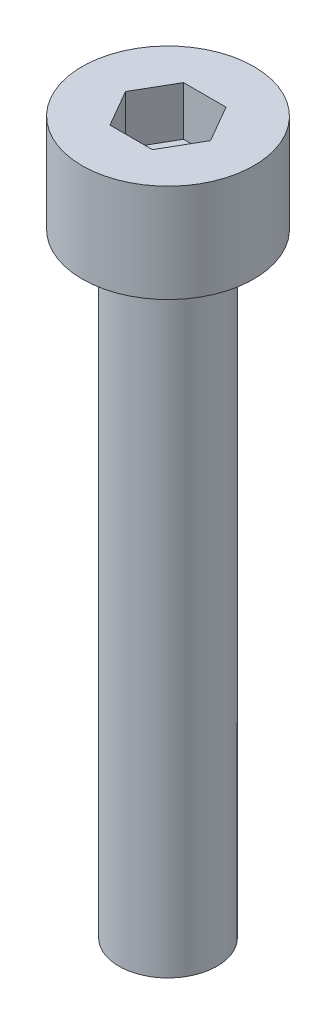
ISO-10303-21;
HEADER;
FILE_DESCRIPTION(('STEP AP214'),'2;1');
FILE_NAME('part.step','',(''),(''),'','','');
FILE_SCHEMA(('AUTOMOTIVE_DESIGN { 1 0 10303 214 1 1 1 1 }'));
ENDSEC;
DATA;
#1=APPLICATION_CONTEXT('core data for automotive mechanical design processes');
#2=APPLICATION_PROTOCOL_DEFINITION('international standard','automotive_design',2000,#1);
#3=PRODUCT_CONTEXT('',#1,'mechanical');
#4=PRODUCT('Part','Part','',(#3));
#5=PRODUCT_RELATED_PRODUCT_CATEGORY('part','',(#4));
#6=PRODUCT_DEFINITION_FORMATION('','',#4);
#7=PRODUCT_DEFINITION_CONTEXT('part definition',#1,'design');
#8=PRODUCT_DEFINITION('design','',#6,#7);
#9=PRODUCT_DEFINITION_SHAPE('','',#8);
#10=(LENGTH_UNIT() NAMED_UNIT(*) SI_UNIT(.MILLI.,.METRE.));
#11=(NAMED_UNIT(*) PLANE_ANGLE_UNIT() SI_UNIT($,.RADIAN.));
#12=(NAMED_UNIT(*) SI_UNIT($,.STERADIAN.) SOLID_ANGLE_UNIT());
#13=UNCERTAINTY_MEASURE_WITH_UNIT(LENGTH_MEASURE(1.E-05),#10,'distance_accuracy_value','');
#14=(GEOMETRIC_REPRESENTATION_CONTEXT(3) GLOBAL_UNCERTAINTY_ASSIGNED_CONTEXT((#13)) GLOBAL_UNIT_ASSIGNED_CONTEXT((#10,
#11,#12)) REPRESENTATION_CONTEXT('',''));
#15=CARTESIAN_POINT('',(0.,0.,0.));
#16=DIRECTION('',(0.,0.,1.));
#17=DIRECTION('',(1.,0.,0.));
#18=AXIS2_PLACEMENT_3D('',#15,#16,#17);
#19=CARTESIAN_POINT('',(0.,4.,0.));
#20=DIRECTION('',(0.,-1.,0.));
#21=DIRECTION('',(0.,0.,-1.));
#22=AXIS2_PLACEMENT_3D('',#19,#20,#21);
#23=CYLINDRICAL_SURFACE('',#22,3.5);
#24=CARTESIAN_POINT('',(0.,4.,0.));
#25=DIRECTION('',(0.,1.,0.));
#26=DIRECTION('',(0.,0.,1.));
#27=AXIS2_PLACEMENT_3D('',#24,#25,#26);
#28=CIRCLE('',#27,3.5);
#29=CARTESIAN_POINT('',(0.,4.,3.5));
#30=VERTEX_POINT('',#29);
#31=EDGE_CURVE('E43',#30,#30,#28,.T.);
#32=ORIENTED_EDGE('',*,*,#31,.F.);
#33=EDGE_LOOP('',(#32));
#34=FACE_BOUND('',#33,.T.);
#35=CARTESIAN_POINT('',(0.,0.,0.));
#36=DIRECTION('',(0.,1.,0.));
#37=DIRECTION('',(0.,0.,1.));
#38=AXIS2_PLACEMENT_3D('',#35,#36,#37);
#39=CIRCLE('',#38,3.5);
#40=CARTESIAN_POINT('',(0.,0.,3.5));
#41=VERTEX_POINT('',#40);
#42=EDGE_CURVE('E38',#41,#41,#39,.T.);
#43=ORIENTED_EDGE('',*,*,#42,.T.);
#44=EDGE_LOOP('',(#43));
#45=FACE_BOUND('',#44,.T.);
#46=ADVANCED_FACE('F35',(#34,#45),#23,.T.);
#47=CARTESIAN_POINT('',(0.,4.,0.));
#48=DIRECTION('',(0.,1.,0.));
#49=DIRECTION('',(0.,0.,1.));
#50=AXIS2_PLACEMENT_3D('',#47,#48,#49);
#51=PLANE('',#50);
#52=DIRECTION('',(0.5,0.,-0.866025403784439));
#53=VECTOR('',#52,1.);
#54=CARTESIAN_POINT('',(0.866025403784438,4.,1.5));
#55=LINE('',#54,#53);
#56=CARTESIAN_POINT('',(0.866025403784438,4.,1.5));
#57=VERTEX_POINT('',#56);
#58=CARTESIAN_POINT('',(1.73205080756888,4.,0.));
#59=VERTEX_POINT('',#58);
#60=EDGE_CURVE('E51',#57,#59,#55,.T.);
#61=ORIENTED_EDGE('',*,*,#60,.F.);
#62=DIRECTION('',(1.,0.,0.));
#63=VECTOR('',#62,1.);
#64=CARTESIAN_POINT('',(-0.866025403784439,4.,1.5));
#65=LINE('',#64,#63);
#66=CARTESIAN_POINT('',(-0.866025403784439,4.,1.5));
#67=VERTEX_POINT('',#66);
#68=EDGE_CURVE('E135',#67,#57,#65,.T.);
#69=ORIENTED_EDGE('',*,*,#68,.F.);
#70=DIRECTION('',(0.5,0.,0.866025403784438));
#71=VECTOR('',#70,1.);
#72=CARTESIAN_POINT('',(-1.73205080756888,4.,0.));
#73=LINE('',#72,#71);
#74=CARTESIAN_POINT('',(-1.73205080756888,4.,0.));
#75=VERTEX_POINT('',#74);
#76=EDGE_CURVE('E133',#75,#67,#73,.T.);
#77=ORIENTED_EDGE('',*,*,#76,.F.);
#78=DIRECTION('',(-0.5,0.,0.866025403784439));
#79=VECTOR('',#78,1.);
#80=CARTESIAN_POINT('',(-0.866025403784439,4.,-1.5));
#81=LINE('',#80,#79);
#82=CARTESIAN_POINT('',(-0.866025403784439,4.,-1.5));
#83=VERTEX_POINT('',#82);
#84=EDGE_CURVE('E99',#83,#75,#81,.T.);
#85=ORIENTED_EDGE('',*,*,#84,.F.);
#86=DIRECTION('',(-1.,0.,0.));
#87=VECTOR('',#86,1.);
#88=CARTESIAN_POINT('',(0.866025403784438,4.,-1.5));
#89=LINE('',#88,#87);
#90=CARTESIAN_POINT('',(0.866025403784438,4.,-1.5));
#91=VERTEX_POINT('',#90);
#92=EDGE_CURVE('E129',#91,#83,#89,.T.);
#93=ORIENTED_EDGE('',*,*,#92,.F.);
#94=DIRECTION('',(-0.5,0.,-0.866025403784439));
#95=VECTOR('',#94,1.);
#96=CARTESIAN_POINT('',(1.73205080756888,4.,0.));
#97=LINE('',#96,#95);
#98=EDGE_CURVE('E125',#59,#91,#97,.T.);
#99=ORIENTED_EDGE('',*,*,#98,.F.);
#100=EDGE_LOOP('',(#61,#69,#77,#85,#93,#99));
#101=FACE_BOUND('',#100,.T.);
#102=ORIENTED_EDGE('',*,*,#31,.T.);
#103=EDGE_LOOP('',(#102));
#104=FACE_BOUND('',#103,.T.);
#105=ADVANCED_FACE('F153',(#101,#104),#51,.T.);
#106=CARTESIAN_POINT('',(0.,0.,0.));
#107=DIRECTION('',(0.,1.,0.));
#108=DIRECTION('',(0.,0.,1.));
#109=AXIS2_PLACEMENT_3D('',#106,#107,#108);
#110=PLANE('',#109);
#111=CARTESIAN_POINT('',(0.,0.,0.));
#112=DIRECTION('',(0.,-1.,0.));
#113=DIRECTION('',(0.,0.,-1.));
#114=AXIS2_PLACEMENT_3D('',#111,#112,#113);
#115=CIRCLE('',#114,2.);
#116=CARTESIAN_POINT('',(0.,0.,-2.));
#117=VERTEX_POINT('',#116);
#118=EDGE_CURVE('E11',#117,#117,#115,.T.);
#119=ORIENTED_EDGE('',*,*,#118,.F.);
#120=EDGE_LOOP('',(#119));
#121=FACE_BOUND('',#120,.T.);
#122=ORIENTED_EDGE('',*,*,#42,.F.);
#123=EDGE_LOOP('',(#122));
#124=FACE_BOUND('',#123,.T.);
#125=ADVANCED_FACE('F150',(#121,#124),#110,.F.);
#126=CARTESIAN_POINT('',(0.866025403784438,2.,1.5));
#127=DIRECTION('',(0.866025403784439,0.,0.5));
#128=DIRECTION('',(0.5,0.,-0.866025403784439));
#129=AXIS2_PLACEMENT_3D('',#126,#127,#128);
#130=PLANE('',#129);
#131=ORIENTED_EDGE('',*,*,#60,.T.);
#132=DIRECTION('',(0.,1.,0.));
#133=VECTOR('',#132,1.);
#134=CARTESIAN_POINT('',(1.73205080756888,2.,0.));
#135=LINE('',#134,#133);
#136=CARTESIAN_POINT('',(1.73205080756888,2.,0.));
#137=VERTEX_POINT('',#136);
#138=EDGE_CURVE('E81',#137,#59,#135,.T.);
#139=ORIENTED_EDGE('',*,*,#138,.F.);
#140=DIRECTION('',(0.5,0.,-0.866025403784439));
#141=VECTOR('',#140,1.);
#142=CARTESIAN_POINT('',(0.866025403784438,2.,1.5));
#143=LINE('',#142,#141);
#144=CARTESIAN_POINT('',(0.866025403784438,2.,1.5));
#145=VERTEX_POINT('',#144);
#146=EDGE_CURVE('E137',#145,#137,#143,.T.);
#147=ORIENTED_EDGE('',*,*,#146,.F.);
#148=DIRECTION('',(0.,1.,0.));
#149=VECTOR('',#148,1.);
#150=CARTESIAN_POINT('',(0.866025403784438,2.,1.5));
#151=LINE('',#150,#149);
#152=EDGE_CURVE('E59',#145,#57,#151,.T.);
#153=ORIENTED_EDGE('',*,*,#152,.T.);
#154=EDGE_LOOP('',(#131,#139,#147,#153));
#155=FACE_BOUND('',#154,.T.);
#156=ADVANCED_FACE('F152',(#155),#130,.F.);
#157=CARTESIAN_POINT('',(-0.866025403784439,2.,1.5));
#158=DIRECTION('',(0.,0.,1.));
#159=DIRECTION('',(1.,0.,0.));
#160=AXIS2_PLACEMENT_3D('',#157,#158,#159);
#161=PLANE('',#160);
#162=ORIENTED_EDGE('',*,*,#68,.T.);
#163=ORIENTED_EDGE('',*,*,#152,.F.);
#164=DIRECTION('',(1.,0.,0.));
#165=VECTOR('',#164,1.);
#166=CARTESIAN_POINT('',(-0.866025403784439,2.,1.5));
#167=LINE('',#166,#165);
#168=CARTESIAN_POINT('',(-0.866025403784439,2.,1.5));
#169=VERTEX_POINT('',#168);
#170=EDGE_CURVE('E111',#169,#145,#167,.T.);
#171=ORIENTED_EDGE('',*,*,#170,.F.);
#172=DIRECTION('',(0.,1.,0.));
#173=VECTOR('',#172,1.);
#174=CARTESIAN_POINT('',(-0.866025403784439,2.,1.5));
#175=LINE('',#174,#173);
#176=EDGE_CURVE('E103',#169,#67,#175,.T.);
#177=ORIENTED_EDGE('',*,*,#176,.T.);
#178=EDGE_LOOP('',(#162,#163,#171,#177));
#179=FACE_BOUND('',#178,.T.);
#180=ADVANCED_FACE('F159',(#179),#161,.F.);
#181=CARTESIAN_POINT('',(-1.73205080756888,2.,0.));
#182=DIRECTION('',(-0.866025403784439,0.,0.5));
#183=DIRECTION('',(0.5,0.,0.866025403784438));
#184=AXIS2_PLACEMENT_3D('',#181,#182,#183);
#185=PLANE('',#184);
#186=ORIENTED_EDGE('',*,*,#76,.T.);
#187=ORIENTED_EDGE('',*,*,#176,.F.);
#188=DIRECTION('',(0.5,0.,0.866025403784438));
#189=VECTOR('',#188,1.);
#190=CARTESIAN_POINT('',(-1.73205080756888,2.,0.));
#191=LINE('',#190,#189);
#192=CARTESIAN_POINT('',(-1.73205080756888,2.,0.));
#193=VERTEX_POINT('',#192);
#194=EDGE_CURVE('E107',#193,#169,#191,.T.);
#195=ORIENTED_EDGE('',*,*,#194,.F.);
#196=DIRECTION('',(0.,1.,0.));
#197=VECTOR('',#196,1.);
#198=CARTESIAN_POINT('',(-1.73205080756888,2.,0.));
#199=LINE('',#198,#197);
#200=EDGE_CURVE('E92',#193,#75,#199,.T.);
#201=ORIENTED_EDGE('',*,*,#200,.T.);
#202=EDGE_LOOP('',(#186,#187,#195,#201));
#203=FACE_BOUND('',#202,.T.);
#204=ADVANCED_FACE('F108',(#203),#185,.F.);
#205=CARTESIAN_POINT('',(-0.866025403784439,2.,-1.5));
#206=DIRECTION('',(-0.866025403784439,0.,-0.5));
#207=DIRECTION('',(-0.5,0.,0.866025403784439));
#208=AXIS2_PLACEMENT_3D('',#205,#206,#207);
#209=PLANE('',#208);
#210=ORIENTED_EDGE('',*,*,#84,.T.);
#211=ORIENTED_EDGE('',*,*,#200,.F.);
#212=DIRECTION('',(-0.5,0.,0.866025403784439));
#213=VECTOR('',#212,1.);
#214=CARTESIAN_POINT('',(-0.866025403784439,2.,-1.5));
#215=LINE('',#214,#213);
#216=CARTESIAN_POINT('',(-0.866025403784439,2.,-1.5));
#217=VERTEX_POINT('',#216);
#218=EDGE_CURVE('E96',#217,#193,#215,.T.);
#219=ORIENTED_EDGE('',*,*,#218,.F.);
#220=DIRECTION('',(0.,1.,0.));
#221=VECTOR('',#220,1.);
#222=CARTESIAN_POINT('',(-0.866025403784439,2.,-1.5));
#223=LINE('',#222,#221);
#224=EDGE_CURVE('E104',#217,#83,#223,.T.);
#225=ORIENTED_EDGE('',*,*,#224,.T.);
#226=EDGE_LOOP('',(#210,#211,#219,#225));
#227=FACE_BOUND('',#226,.T.);
#228=ADVANCED_FACE('F94',(#227),#209,.F.);
#229=CARTESIAN_POINT('',(0.866025403784438,2.,-1.5));
#230=DIRECTION('',(0.,0.,-1.));
#231=DIRECTION('',(-1.,0.,0.));
#232=AXIS2_PLACEMENT_3D('',#229,#230,#231);
#233=PLANE('',#232);
#234=ORIENTED_EDGE('',*,*,#92,.T.);
#235=ORIENTED_EDGE('',*,*,#224,.F.);
#236=DIRECTION('',(-1.,0.,0.));
#237=VECTOR('',#236,1.);
#238=CARTESIAN_POINT('',(0.866025403784438,2.,-1.5));
#239=LINE('',#238,#237);
#240=CARTESIAN_POINT('',(0.866025403784438,2.,-1.5));
#241=VERTEX_POINT('',#240);
#242=EDGE_CURVE('E117',#241,#217,#239,.T.);
#243=ORIENTED_EDGE('',*,*,#242,.F.);
#244=DIRECTION('',(0.,1.,0.));
#245=VECTOR('',#244,1.);
#246=CARTESIAN_POINT('',(0.866025403784438,2.,-1.5));
#247=LINE('',#246,#245);
#248=EDGE_CURVE('E141',#241,#91,#247,.T.);
#249=ORIENTED_EDGE('',*,*,#248,.T.);
#250=EDGE_LOOP('',(#234,#235,#243,#249));
#251=FACE_BOUND('',#250,.T.);
#252=ADVANCED_FACE('F204',(#251),#233,.F.);
#253=CARTESIAN_POINT('',(1.73205080756888,2.,0.));
#254=DIRECTION('',(0.866025403784439,0.,-0.5));
#255=DIRECTION('',(-0.5,0.,-0.866025403784439));
#256=AXIS2_PLACEMENT_3D('',#253,#254,#255);
#257=PLANE('',#256);
#258=ORIENTED_EDGE('',*,*,#98,.T.);
#259=ORIENTED_EDGE('',*,*,#248,.F.);
#260=DIRECTION('',(-0.5,0.,-0.866025403784439));
#261=VECTOR('',#260,1.);
#262=CARTESIAN_POINT('',(1.73205080756888,2.,0.));
#263=LINE('',#262,#261);
#264=EDGE_CURVE('E119',#137,#241,#263,.T.);
#265=ORIENTED_EDGE('',*,*,#264,.F.);
#266=ORIENTED_EDGE('',*,*,#138,.T.);
#267=EDGE_LOOP('',(#258,#259,#265,#266));
#268=FACE_BOUND('',#267,.T.);
#269=ADVANCED_FACE('F213',(#268),#257,.F.);
#270=CARTESIAN_POINT('',(0.,2.,0.));
#271=DIRECTION('',(0.,1.,0.));
#272=DIRECTION('',(0.,0.,1.));
#273=AXIS2_PLACEMENT_3D('',#270,#271,#272);
#274=PLANE('',#273);
#275=ORIENTED_EDGE('',*,*,#146,.T.);
#276=ORIENTED_EDGE('',*,*,#264,.T.);
#277=ORIENTED_EDGE('',*,*,#242,.T.);
#278=ORIENTED_EDGE('',*,*,#218,.T.);
#279=ORIENTED_EDGE('',*,*,#194,.T.);
#280=ORIENTED_EDGE('',*,*,#170,.T.);
#281=EDGE_LOOP('',(#275,#276,#277,#278,#279,#280));
#282=FACE_BOUND('',#281,.T.);
#283=ADVANCED_FACE('F114',(#282),#274,.T.);
#284=CARTESIAN_POINT('',(0.,-25.,0.));
#285=DIRECTION('',(0.,1.,0.));
#286=DIRECTION('',(0.,0.,1.));
#287=AXIS2_PLACEMENT_3D('',#284,#285,#286);
#288=CYLINDRICAL_SURFACE('',#287,2.);
#289=CARTESIAN_POINT('',(0.,-25.,0.));
#290=DIRECTION('',(0.,-1.,0.));
#291=DIRECTION('',(0.,0.,-1.));
#292=AXIS2_PLACEMENT_3D('',#289,#290,#291);
#293=CIRCLE('',#292,2.);
#294=CARTESIAN_POINT('',(0.,-25.,-2.));
#295=VERTEX_POINT('',#294);
#296=EDGE_CURVE('E126',#295,#295,#293,.T.);
#297=ORIENTED_EDGE('',*,*,#296,.F.);
#298=EDGE_LOOP('',(#297));
#299=FACE_BOUND('',#298,.T.);
#300=ORIENTED_EDGE('',*,*,#118,.T.);
#301=EDGE_LOOP('',(#300));
#302=FACE_BOUND('',#301,.T.);
#303=ADVANCED_FACE('F231',(#299,#302),#288,.T.);
#304=CARTESIAN_POINT('',(0.,-25.,0.));
#305=DIRECTION('',(0.,-1.,0.));
#306=DIRECTION('',(0.,0.,-1.));
#307=AXIS2_PLACEMENT_3D('',#304,#305,#306);
#308=PLANE('',#307);
#309=ORIENTED_EDGE('',*,*,#296,.T.);
#310=EDGE_LOOP('',(#309));
#311=FACE_BOUND('',#310,.T.);
#312=ADVANCED_FACE('F244',(#311),#308,.T.);
#313=CLOSED_SHELL('',(#46,#105,#125,#156,#180,#204,#228,#252,#269,#283,#303,#312));
#314=MANIFOLD_SOLID_BREP('B2',#313);
#315=ADVANCED_BREP_SHAPE_REPRESENTATION('',(#18,#314),#14);
#316=SHAPE_DEFINITION_REPRESENTATION(#9,#315);
ENDSEC;
END-ISO-10303-21;
